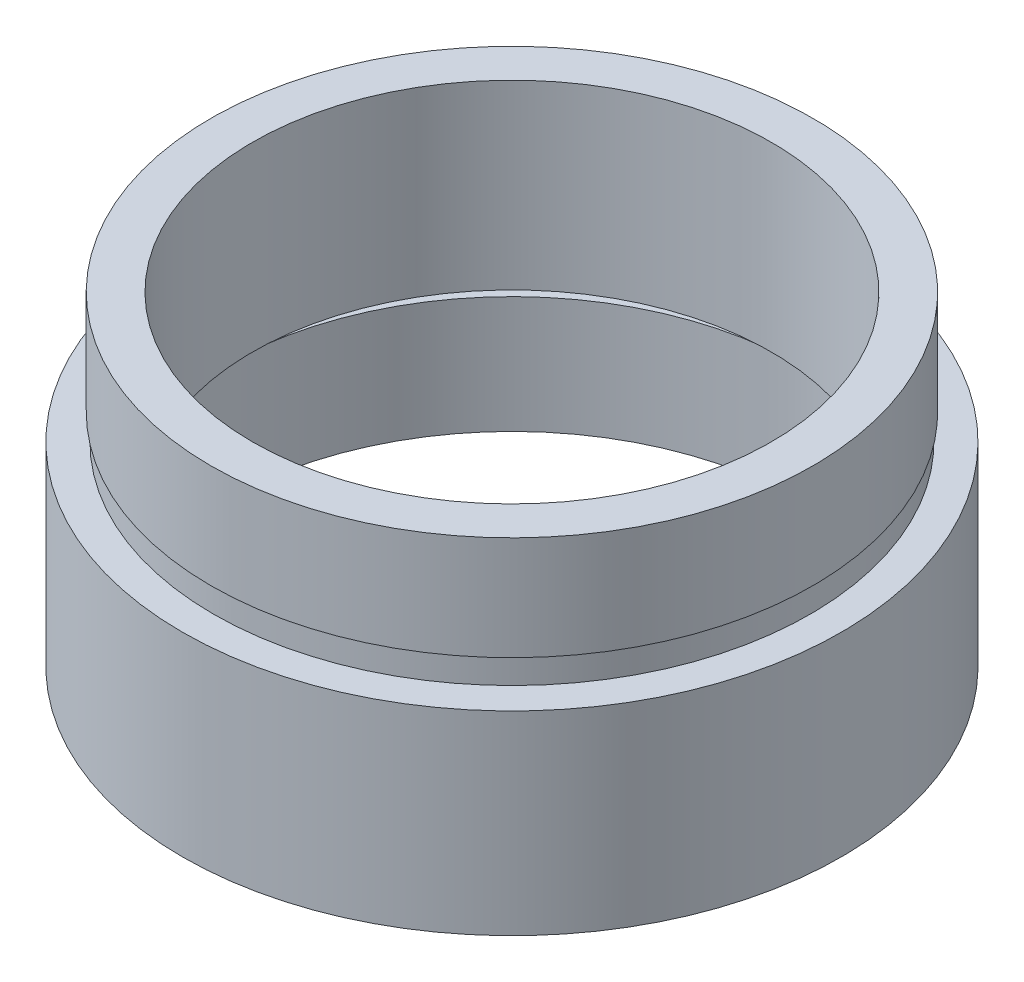
ISO-10303-21;
HEADER;
FILE_DESCRIPTION(('STEP AP214'),'2;1');
FILE_NAME('part.step','',(''),(''),'','','');
FILE_SCHEMA(('AUTOMOTIVE_DESIGN { 1 0 10303 214 1 1 1 1 }'));
ENDSEC;
DATA;
#1=APPLICATION_CONTEXT('core data for automotive mechanical design processes');
#2=APPLICATION_PROTOCOL_DEFINITION('international standard','automotive_design',2000,#1);
#3=PRODUCT_CONTEXT('',#1,'mechanical');
#4=PRODUCT('Part','Part','',(#3));
#5=PRODUCT_RELATED_PRODUCT_CATEGORY('part','',(#4));
#6=PRODUCT_DEFINITION_FORMATION('','',#4);
#7=PRODUCT_DEFINITION_CONTEXT('part definition',#1,'design');
#8=PRODUCT_DEFINITION('design','',#6,#7);
#9=PRODUCT_DEFINITION_SHAPE('','',#8);
#10=(LENGTH_UNIT() NAMED_UNIT(*) SI_UNIT(.MILLI.,.METRE.));
#11=(NAMED_UNIT(*) PLANE_ANGLE_UNIT() SI_UNIT($,.RADIAN.));
#12=(NAMED_UNIT(*) SI_UNIT($,.STERADIAN.) SOLID_ANGLE_UNIT());
#13=UNCERTAINTY_MEASURE_WITH_UNIT(LENGTH_MEASURE(1.E-05),#10,'distance_accuracy_value','');
#14=(GEOMETRIC_REPRESENTATION_CONTEXT(3) GLOBAL_UNCERTAINTY_ASSIGNED_CONTEXT((#13)) GLOBAL_UNIT_ASSIGNED_CONTEXT((#10,
#11,#12)) REPRESENTATION_CONTEXT('',''));
#15=CARTESIAN_POINT('',(0.,0.,0.));
#16=DIRECTION('',(0.,0.,1.));
#17=DIRECTION('',(1.,0.,0.));
#18=AXIS2_PLACEMENT_3D('',#15,#16,#17);
#19=CARTESIAN_POINT('',(11.1,0.,0.));
#20=DIRECTION('',(0.,1.,0.));
#21=DIRECTION('',(0.,0.,1.));
#22=AXIS2_PLACEMENT_3D('',#19,#20,#21);
#23=PLANE('',#22);
#24=CARTESIAN_POINT('',(0.,0.,0.));
#25=DIRECTION('',(0.,1.,0.));
#26=DIRECTION('',(0.,0.,1.));
#27=AXIS2_PLACEMENT_3D('',#24,#25,#26);
#28=CIRCLE('',#27,12.7);
#29=CARTESIAN_POINT('',(0.,0.,12.7));
#30=VERTEX_POINT('',#29);
#31=EDGE_CURVE('E10',#30,#30,#28,.T.);
#32=ORIENTED_EDGE('',*,*,#31,.F.);
#33=EDGE_LOOP('',(#32));
#34=FACE_BOUND('',#33,.T.);
#35=CARTESIAN_POINT('',(0.,0.,0.));
#36=DIRECTION('',(0.,1.,0.));
#37=DIRECTION('',(0.,0.,1.));
#38=AXIS2_PLACEMENT_3D('',#35,#36,#37);
#39=CIRCLE('',#38,11.1);
#40=CARTESIAN_POINT('',(0.,0.,11.1));
#41=VERTEX_POINT('',#40);
#42=EDGE_CURVE('E92',#41,#41,#39,.T.);
#43=ORIENTED_EDGE('',*,*,#42,.T.);
#44=EDGE_LOOP('',(#43));
#45=FACE_BOUND('',#44,.T.);
#46=ADVANCED_FACE('F41',(#34,#45),#23,.F.);
#47=CARTESIAN_POINT('',(0.,161.376166943427,0.));
#48=DIRECTION('',(0.,1.,0.));
#49=DIRECTION('',(0.,0.,1.));
#50=AXIS2_PLACEMENT_3D('',#47,#48,#49);
#51=CYLINDRICAL_SURFACE('',#50,12.7);
#52=CARTESIAN_POINT('',(0.,7.49999999999998,0.));
#53=DIRECTION('',(0.,1.,0.));
#54=DIRECTION('',(0.,0.,1.));
#55=AXIS2_PLACEMENT_3D('',#52,#53,#54);
#56=CIRCLE('',#55,12.7);
#57=CARTESIAN_POINT('',(0.,7.49999999999998,12.7));
#58=VERTEX_POINT('',#57);
#59=EDGE_CURVE('E48',#58,#58,#56,.T.);
#60=ORIENTED_EDGE('',*,*,#59,.F.);
#61=EDGE_LOOP('',(#60));
#62=FACE_BOUND('',#61,.T.);
#63=ORIENTED_EDGE('',*,*,#31,.T.);
#64=EDGE_LOOP('',(#63));
#65=FACE_BOUND('',#64,.T.);
#66=ADVANCED_FACE('F154',(#62,#65),#51,.T.);
#67=CARTESIAN_POINT('',(12.7,7.49999999999998,0.));
#68=DIRECTION('',(0.,-1.,0.));
#69=DIRECTION('',(0.,0.,-1.));
#70=AXIS2_PLACEMENT_3D('',#67,#68,#69);
#71=PLANE('',#70);
#72=CARTESIAN_POINT('',(0.,7.49999999999998,0.));
#73=DIRECTION('',(0.,1.,0.));
#74=DIRECTION('',(0.,0.,1.));
#75=AXIS2_PLACEMENT_3D('',#72,#73,#74);
#76=CIRCLE('',#75,11.5);
#77=CARTESIAN_POINT('',(0.,7.49999999999998,11.5));
#78=VERTEX_POINT('',#77);
#79=EDGE_CURVE('E55',#78,#78,#76,.T.);
#80=ORIENTED_EDGE('',*,*,#79,.F.);
#81=EDGE_LOOP('',(#80));
#82=FACE_BOUND('',#81,.T.);
#83=ORIENTED_EDGE('',*,*,#59,.T.);
#84=EDGE_LOOP('',(#83));
#85=FACE_BOUND('',#84,.T.);
#86=ADVANCED_FACE('F149',(#82,#85),#71,.F.);
#87=CARTESIAN_POINT('',(0.,161.376166943427,0.));
#88=DIRECTION('',(0.,1.,0.));
#89=DIRECTION('',(0.,0.,1.));
#90=AXIS2_PLACEMENT_3D('',#87,#88,#89);
#91=CYLINDRICAL_SURFACE('',#90,11.5);
#92=CARTESIAN_POINT('',(0.,8.49999999999998,0.));
#93=DIRECTION('',(0.,1.,0.));
#94=DIRECTION('',(0.,0.,1.));
#95=AXIS2_PLACEMENT_3D('',#92,#93,#94);
#96=CIRCLE('',#95,11.5);
#97=CARTESIAN_POINT('',(0.,8.49999999999998,11.5));
#98=VERTEX_POINT('',#97);
#99=EDGE_CURVE('E61',#98,#98,#96,.T.);
#100=ORIENTED_EDGE('',*,*,#99,.F.);
#101=EDGE_LOOP('',(#100));
#102=FACE_BOUND('',#101,.T.);
#103=ORIENTED_EDGE('',*,*,#79,.T.);
#104=EDGE_LOOP('',(#103));
#105=FACE_BOUND('',#104,.T.);
#106=ADVANCED_FACE('F143',(#102,#105),#91,.T.);
#107=CARTESIAN_POINT('',(11.5,8.49999999999999,0.));
#108=DIRECTION('',(0.,1.,0.));
#109=DIRECTION('',(0.,0.,1.));
#110=AXIS2_PLACEMENT_3D('',#107,#108,#109);
#111=PLANE('',#110);
#112=CARTESIAN_POINT('',(0.,8.49999999999998,0.));
#113=DIRECTION('',(0.,1.,0.));
#114=DIRECTION('',(0.,0.,1.));
#115=AXIS2_PLACEMENT_3D('',#112,#113,#114);
#116=CIRCLE('',#115,11.6);
#117=CARTESIAN_POINT('',(0.,8.49999999999998,11.6));
#118=VERTEX_POINT('',#117);
#119=EDGE_CURVE('E67',#118,#118,#116,.T.);
#120=ORIENTED_EDGE('',*,*,#119,.F.);
#121=EDGE_LOOP('',(#120));
#122=FACE_BOUND('',#121,.T.);
#123=ORIENTED_EDGE('',*,*,#99,.T.);
#124=EDGE_LOOP('',(#123));
#125=FACE_BOUND('',#124,.T.);
#126=ADVANCED_FACE('F137',(#122,#125),#111,.F.);
#127=CARTESIAN_POINT('',(0.,161.376166943427,0.));
#128=DIRECTION('',(0.,1.,0.));
#129=DIRECTION('',(0.,0.,1.));
#130=AXIS2_PLACEMENT_3D('',#127,#128,#129);
#131=CYLINDRICAL_SURFACE('',#130,11.6);
#132=CARTESIAN_POINT('',(0.,12.5,0.));
#133=DIRECTION('',(0.,1.,0.));
#134=DIRECTION('',(0.,0.,1.));
#135=AXIS2_PLACEMENT_3D('',#132,#133,#134);
#136=CIRCLE('',#135,11.6);
#137=CARTESIAN_POINT('',(0.,12.5,11.6));
#138=VERTEX_POINT('',#137);
#139=EDGE_CURVE('E71',#138,#138,#136,.T.);
#140=ORIENTED_EDGE('',*,*,#139,.F.);
#141=EDGE_LOOP('',(#140));
#142=FACE_BOUND('',#141,.T.);
#143=ORIENTED_EDGE('',*,*,#119,.T.);
#144=EDGE_LOOP('',(#143));
#145=FACE_BOUND('',#144,.T.);
#146=ADVANCED_FACE('F131',(#142,#145),#131,.T.);
#147=CARTESIAN_POINT('',(11.6,12.5,0.));
#148=DIRECTION('',(0.,-1.,0.));
#149=DIRECTION('',(0.,0.,-1.));
#150=AXIS2_PLACEMENT_3D('',#147,#148,#149);
#151=PLANE('',#150);
#152=CARTESIAN_POINT('',(0.,12.5,0.));
#153=DIRECTION('',(0.,1.,0.));
#154=DIRECTION('',(0.,0.,1.));
#155=AXIS2_PLACEMENT_3D('',#152,#153,#154);
#156=CIRCLE('',#155,10.);
#157=CARTESIAN_POINT('',(0.,12.5,10.));
#158=VERTEX_POINT('',#157);
#159=EDGE_CURVE('E74',#158,#158,#156,.T.);
#160=ORIENTED_EDGE('',*,*,#159,.F.);
#161=EDGE_LOOP('',(#160));
#162=FACE_BOUND('',#161,.T.);
#163=ORIENTED_EDGE('',*,*,#139,.T.);
#164=EDGE_LOOP('',(#163));
#165=FACE_BOUND('',#164,.T.);
#166=ADVANCED_FACE('F125',(#162,#165),#151,.F.);
#167=CARTESIAN_POINT('',(0.,161.376166943427,0.));
#168=DIRECTION('',(0.,1.,0.));
#169=DIRECTION('',(0.,0.,1.));
#170=AXIS2_PLACEMENT_3D('',#167,#168,#169);
#171=CYLINDRICAL_SURFACE('',#170,10.);
#172=CARTESIAN_POINT('',(0.,5.49999999999998,0.));
#173=DIRECTION('',(0.,1.,0.));
#174=DIRECTION('',(0.,0.,1.));
#175=AXIS2_PLACEMENT_3D('',#172,#173,#174);
#176=CIRCLE('',#175,10.);
#177=CARTESIAN_POINT('',(0.,5.49999999999998,10.));
#178=VERTEX_POINT('',#177);
#179=EDGE_CURVE('E78',#178,#178,#176,.T.);
#180=ORIENTED_EDGE('',*,*,#179,.F.);
#181=EDGE_LOOP('',(#180));
#182=FACE_BOUND('',#181,.T.);
#183=ORIENTED_EDGE('',*,*,#159,.T.);
#184=EDGE_LOOP('',(#183));
#185=FACE_BOUND('',#184,.T.);
#186=ADVANCED_FACE('F119',(#182,#185),#171,.F.);
#187=CARTESIAN_POINT('',(11.7,5.49999999999998,0.));
#188=DIRECTION('',(0.,1.,0.));
#189=DIRECTION('',(0.,0.,1.));
#190=AXIS2_PLACEMENT_3D('',#187,#188,#189);
#191=PLANE('',#190);
#192=CARTESIAN_POINT('',(0.,5.49999999999998,0.));
#193=DIRECTION('',(0.,1.,0.));
#194=DIRECTION('',(0.,0.,1.));
#195=AXIS2_PLACEMENT_3D('',#192,#193,#194);
#196=CIRCLE('',#195,11.7);
#197=CARTESIAN_POINT('',(0.,5.49999999999998,11.7));
#198=VERTEX_POINT('',#197);
#199=EDGE_CURVE('E81',#198,#198,#196,.T.);
#200=ORIENTED_EDGE('',*,*,#199,.F.);
#201=EDGE_LOOP('',(#200));
#202=FACE_BOUND('',#201,.T.);
#203=ORIENTED_EDGE('',*,*,#179,.T.);
#204=EDGE_LOOP('',(#203));
#205=FACE_BOUND('',#204,.T.);
#206=ADVANCED_FACE('F113',(#202,#205),#191,.F.);
#207=CARTESIAN_POINT('',(0.,161.376166943427,0.));
#208=DIRECTION('',(0.,1.,0.));
#209=DIRECTION('',(0.,0.,1.));
#210=AXIS2_PLACEMENT_3D('',#207,#208,#209);
#211=CYLINDRICAL_SURFACE('',#210,11.7);
#212=CARTESIAN_POINT('',(0.,4.49999999999998,0.));
#213=DIRECTION('',(0.,1.,0.));
#214=DIRECTION('',(0.,0.,1.));
#215=AXIS2_PLACEMENT_3D('',#212,#213,#214);
#216=CIRCLE('',#215,11.7);
#217=CARTESIAN_POINT('',(0.,4.49999999999998,11.7));
#218=VERTEX_POINT('',#217);
#219=EDGE_CURVE('E85',#218,#218,#216,.T.);
#220=ORIENTED_EDGE('',*,*,#219,.F.);
#221=EDGE_LOOP('',(#220));
#222=FACE_BOUND('',#221,.T.);
#223=ORIENTED_EDGE('',*,*,#199,.T.);
#224=EDGE_LOOP('',(#223));
#225=FACE_BOUND('',#224,.T.);
#226=ADVANCED_FACE('F107',(#222,#225),#211,.F.);
#227=CARTESIAN_POINT('',(11.1,4.49999999999998,0.));
#228=DIRECTION('',(0.,-1.,0.));
#229=DIRECTION('',(0.,0.,-1.));
#230=AXIS2_PLACEMENT_3D('',#227,#228,#229);
#231=PLANE('',#230);
#232=CARTESIAN_POINT('',(0.,4.49999999999998,0.));
#233=DIRECTION('',(0.,1.,0.));
#234=DIRECTION('',(0.,0.,1.));
#235=AXIS2_PLACEMENT_3D('',#232,#233,#234);
#236=CIRCLE('',#235,11.1);
#237=CARTESIAN_POINT('',(0.,4.49999999999998,11.1));
#238=VERTEX_POINT('',#237);
#239=EDGE_CURVE('E89',#238,#238,#236,.T.);
#240=ORIENTED_EDGE('',*,*,#239,.F.);
#241=EDGE_LOOP('',(#240));
#242=FACE_BOUND('',#241,.T.);
#243=ORIENTED_EDGE('',*,*,#219,.T.);
#244=EDGE_LOOP('',(#243));
#245=FACE_BOUND('',#244,.T.);
#246=ADVANCED_FACE('F101',(#242,#245),#231,.F.);
#247=CARTESIAN_POINT('',(0.,161.376166943427,0.));
#248=DIRECTION('',(0.,1.,0.));
#249=DIRECTION('',(0.,0.,1.));
#250=AXIS2_PLACEMENT_3D('',#247,#248,#249);
#251=CYLINDRICAL_SURFACE('',#250,11.1);
#252=ORIENTED_EDGE('',*,*,#42,.F.);
#253=EDGE_LOOP('',(#252));
#254=FACE_BOUND('',#253,.T.);
#255=ORIENTED_EDGE('',*,*,#239,.T.);
#256=EDGE_LOOP('',(#255));
#257=FACE_BOUND('',#256,.T.);
#258=ADVANCED_FACE('F98',(#254,#257),#251,.F.);
#259=CLOSED_SHELL('',(#46,#66,#86,#106,#126,#146,#166,#186,#206,#226,#246,#258));
#260=MANIFOLD_SOLID_BREP('B2',#259);
#261=ADVANCED_BREP_SHAPE_REPRESENTATION('',(#18,#260),#14);
#262=SHAPE_DEFINITION_REPRESENTATION(#9,#261);
ENDSEC;
END-ISO-10303-21;
